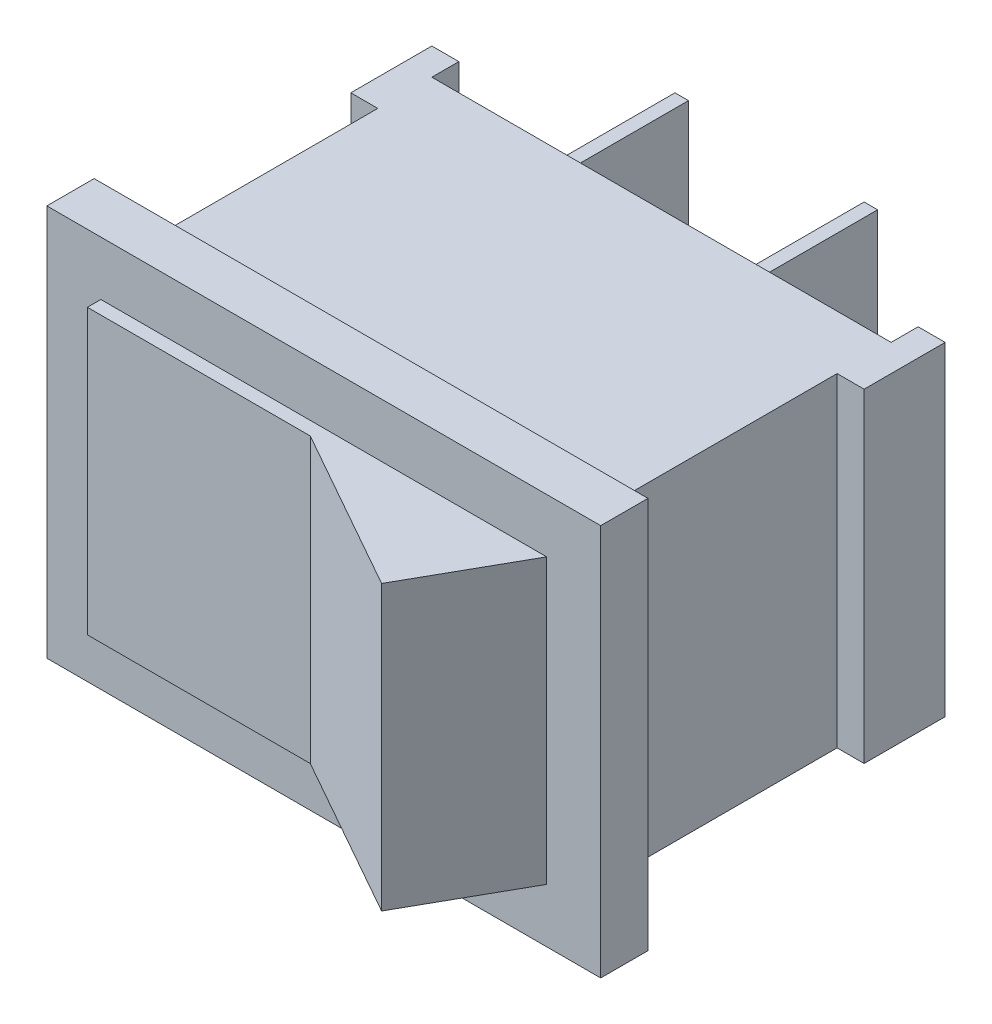
ISO-10303-21;
HEADER;
FILE_DESCRIPTION(('STEP AP214'),'2;1');
FILE_NAME('part.step','',(''),(''),'','','');
FILE_SCHEMA(('AUTOMOTIVE_DESIGN { 1 0 10303 214 1 1 1 1 }'));
ENDSEC;
DATA;
#1=APPLICATION_CONTEXT('core data for automotive mechanical design processes');
#2=APPLICATION_PROTOCOL_DEFINITION('international standard','automotive_design',2000,#1);
#3=PRODUCT_CONTEXT('',#1,'mechanical');
#4=PRODUCT('Part','Part','',(#3));
#5=PRODUCT_RELATED_PRODUCT_CATEGORY('part','',(#4));
#6=PRODUCT_DEFINITION_FORMATION('','',#4);
#7=PRODUCT_DEFINITION_CONTEXT('part definition',#1,'design');
#8=PRODUCT_DEFINITION('design','',#6,#7);
#9=PRODUCT_DEFINITION_SHAPE('','',#8);
#10=(LENGTH_UNIT() NAMED_UNIT(*) SI_UNIT(.MILLI.,.METRE.));
#11=(NAMED_UNIT(*) PLANE_ANGLE_UNIT() SI_UNIT($,.RADIAN.));
#12=(NAMED_UNIT(*) SI_UNIT($,.STERADIAN.) SOLID_ANGLE_UNIT());
#13=UNCERTAINTY_MEASURE_WITH_UNIT(LENGTH_MEASURE(1.E-05),#10,'distance_accuracy_value','');
#14=(GEOMETRIC_REPRESENTATION_CONTEXT(3) GLOBAL_UNCERTAINTY_ASSIGNED_CONTEXT((#13)) GLOBAL_UNIT_ASSIGNED_CONTEXT((#10,
#11,#12)) REPRESENTATION_CONTEXT('',''));
#15=CARTESIAN_POINT('',(0.,0.,0.));
#16=DIRECTION('',(0.,0.,1.));
#17=DIRECTION('',(1.,0.,0.));
#18=AXIS2_PLACEMENT_3D('',#15,#16,#17);
#19=CARTESIAN_POINT('',(0.,0.,-10.75));
#20=DIRECTION('',(0.,0.,-1.));
#21=DIRECTION('',(-1.,0.,0.));
#22=AXIS2_PLACEMENT_3D('',#19,#20,#21);
#23=PLANE('',#22);
#24=DIRECTION('',(-1.,0.,0.));
#25=VECTOR('',#24,1.);
#26=CARTESIAN_POINT('',(-7.5,-2.,-10.75));
#27=LINE('',#26,#25);
#28=CARTESIAN_POINT('',(-7.,-2.,-10.75));
#29=VERTEX_POINT('',#28);
#30=CARTESIAN_POINT('',(-7.5,-2.,-10.75));
#31=VERTEX_POINT('',#30);
#32=EDGE_CURVE('E256',#29,#31,#27,.T.);
#33=ORIENTED_EDGE('',*,*,#32,.F.);
#34=DIRECTION('',(0.,-1.,0.));
#35=VECTOR('',#34,1.);
#36=CARTESIAN_POINT('',(-7.,-2.,-10.75));
#37=LINE('',#36,#35);
#38=CARTESIAN_POINT('',(-7.,2.,-10.75));
#39=VERTEX_POINT('',#38);
#40=EDGE_CURVE('E253',#39,#29,#37,.T.);
#41=ORIENTED_EDGE('',*,*,#40,.F.);
#42=DIRECTION('',(1.,0.,0.));
#43=VECTOR('',#42,1.);
#44=CARTESIAN_POINT('',(-7.5,2.,-10.75));
#45=LINE('',#44,#43);
#46=CARTESIAN_POINT('',(-7.5,2.,-10.75));
#47=VERTEX_POINT('',#46);
#48=EDGE_CURVE('E265',#47,#39,#45,.T.);
#49=ORIENTED_EDGE('',*,*,#48,.F.);
#50=DIRECTION('',(0.,1.,0.));
#51=VECTOR('',#50,1.);
#52=CARTESIAN_POINT('',(-7.5,-2.,-10.75));
#53=LINE('',#52,#51);
#54=EDGE_CURVE('E273',#31,#47,#53,.T.);
#55=ORIENTED_EDGE('',*,*,#54,.F.);
#56=EDGE_LOOP('',(#33,#41,#49,#55));
#57=FACE_BOUND('',#56,.T.);
#58=DIRECTION('',(0.,-1.,0.));
#59=VECTOR('',#58,1.);
#60=CARTESIAN_POINT('',(8.5,-6.,-10.75));
#61=LINE('',#60,#59);
#62=CARTESIAN_POINT('',(8.5,6.,-10.75));
#63=VERTEX_POINT('',#62);
#64=CARTESIAN_POINT('',(8.5,-6.,-10.75));
#65=VERTEX_POINT('',#64);
#66=EDGE_CURVE('E380',#63,#65,#61,.T.);
#67=ORIENTED_EDGE('',*,*,#66,.T.);
#68=DIRECTION('',(-1.,0.,0.));
#69=VECTOR('',#68,1.);
#70=CARTESIAN_POINT('',(-8.5,-6.,-10.75));
#71=LINE('',#70,#69);
#72=CARTESIAN_POINT('',(-8.5,-6.,-10.75));
#73=VERTEX_POINT('',#72);
#74=EDGE_CURVE('E383',#65,#73,#71,.T.);
#75=ORIENTED_EDGE('',*,*,#74,.T.);
#76=DIRECTION('',(0.,1.,0.));
#77=VECTOR('',#76,1.);
#78=CARTESIAN_POINT('',(-8.5,-6.,-10.75));
#79=LINE('',#78,#77);
#80=CARTESIAN_POINT('',(-8.5,6.,-10.75));
#81=VERTEX_POINT('',#80);
#82=EDGE_CURVE('E387',#73,#81,#79,.T.);
#83=ORIENTED_EDGE('',*,*,#82,.T.);
#84=DIRECTION('',(1.,0.,0.));
#85=VECTOR('',#84,1.);
#86=CARTESIAN_POINT('',(-8.5,6.,-10.75));
#87=LINE('',#86,#85);
#88=EDGE_CURVE('E390',#81,#63,#87,.T.);
#89=ORIENTED_EDGE('',*,*,#88,.T.);
#90=EDGE_LOOP('',(#67,#75,#83,#89));
#91=FACE_BOUND('',#90,.T.);
#92=DIRECTION('',(1.,0.,0.));
#93=VECTOR('',#92,1.);
#94=CARTESIAN_POINT('',(0.,2.,-10.75));
#95=LINE('',#94,#93);
#96=CARTESIAN_POINT('',(-0.499999999999998,2.,-10.75));
#97=VERTEX_POINT('',#96);
#98=CARTESIAN_POINT('',(0.,2.,-10.75));
#99=VERTEX_POINT('',#98);
#100=EDGE_CURVE('E812',#97,#99,#95,.T.);
#101=ORIENTED_EDGE('',*,*,#100,.F.);
#102=DIRECTION('',(0.,1.,0.));
#103=VECTOR('',#102,1.);
#104=CARTESIAN_POINT('',(-0.499999999999998,-1.99999999999999,-10.75));
#105=LINE('',#104,#103);
#106=CARTESIAN_POINT('',(-0.499999999999998,-1.99999999999999,-10.75));
#107=VERTEX_POINT('',#106);
#108=EDGE_CURVE('E251',#107,#97,#105,.T.);
#109=ORIENTED_EDGE('',*,*,#108,.F.);
#110=DIRECTION('',(-1.,0.,0.));
#111=VECTOR('',#110,1.);
#112=CARTESIAN_POINT('',(0.,-1.99999999999999,-10.75));
#113=LINE('',#112,#111);
#114=CARTESIAN_POINT('',(0.,-1.99999999999999,-10.75));
#115=VERTEX_POINT('',#114);
#116=EDGE_CURVE('E247',#115,#107,#113,.T.);
#117=ORIENTED_EDGE('',*,*,#116,.F.);
#118=DIRECTION('',(0.,-1.,0.));
#119=VECTOR('',#118,1.);
#120=CARTESIAN_POINT('',(0.,-1.99999999999999,-10.75));
#121=LINE('',#120,#119);
#122=EDGE_CURVE('E809',#99,#115,#121,.T.);
#123=ORIENTED_EDGE('',*,*,#122,.F.);
#124=EDGE_LOOP('',(#101,#109,#117,#123));
#125=FACE_BOUND('',#124,.T.);
#126=ADVANCED_FACE('F36',(#57,#91,#125),#23,.T.);
#127=CARTESIAN_POINT('',(0.,0.,1.75));
#128=DIRECTION('',(0.,0.,1.));
#129=DIRECTION('',(1.,0.,0.));
#130=AXIS2_PLACEMENT_3D('',#127,#128,#129);
#131=PLANE('',#130);
#132=DIRECTION('',(0.,-1.,0.));
#133=VECTOR('',#132,1.);
#134=CARTESIAN_POINT('',(-10.25,-7.25,1.75));
#135=LINE('',#134,#133);
#136=CARTESIAN_POINT('',(-10.25,7.25,1.75));
#137=VERTEX_POINT('',#136);
#138=CARTESIAN_POINT('',(-10.25,-7.25,1.75));
#139=VERTEX_POINT('',#138);
#140=EDGE_CURVE('E412',#137,#139,#135,.T.);
#141=ORIENTED_EDGE('',*,*,#140,.T.);
#142=DIRECTION('',(1.,0.,0.));
#143=VECTOR('',#142,1.);
#144=CARTESIAN_POINT('',(10.25,-7.25,1.75));
#145=LINE('',#144,#143);
#146=CARTESIAN_POINT('',(10.25,-7.25,1.75));
#147=VERTEX_POINT('',#146);
#148=EDGE_CURVE('E415',#139,#147,#145,.T.);
#149=ORIENTED_EDGE('',*,*,#148,.T.);
#150=DIRECTION('',(0.,1.,0.));
#151=VECTOR('',#150,1.);
#152=CARTESIAN_POINT('',(10.25,-7.25,1.75));
#153=LINE('',#152,#151);
#154=CARTESIAN_POINT('',(10.25,7.25000000000001,1.75));
#155=VERTEX_POINT('',#154);
#156=EDGE_CURVE('E418',#147,#155,#153,.T.);
#157=ORIENTED_EDGE('',*,*,#156,.T.);
#158=DIRECTION('',(-1.,0.,0.));
#159=VECTOR('',#158,1.);
#160=CARTESIAN_POINT('',(10.25,7.25000000000001,1.75));
#161=LINE('',#160,#159);
#162=EDGE_CURVE('E420',#155,#137,#161,.T.);
#163=ORIENTED_EDGE('',*,*,#162,.T.);
#164=EDGE_LOOP('',(#141,#149,#157,#163));
#165=FACE_BOUND('',#164,.T.);
#166=DIRECTION('',(-1.,0.,0.));
#167=VECTOR('',#166,1.);
#168=CARTESIAN_POINT('',(0.,5.25000000000001,1.75));
#169=LINE('',#168,#167);
#170=CARTESIAN_POINT('',(8.25,5.25000000000001,1.75));
#171=VERTEX_POINT('',#170);
#172=CARTESIAN_POINT('',(-8.25000000000001,5.25,1.75));
#173=VERTEX_POINT('',#172);
#174=EDGE_CURVE('E299',#171,#173,#169,.T.);
#175=ORIENTED_EDGE('',*,*,#174,.F.);
#176=DIRECTION('',(0.,1.,0.));
#177=VECTOR('',#176,1.);
#178=CARTESIAN_POINT('',(8.25,-14.3786663634202,1.75));
#179=LINE('',#178,#177);
#180=CARTESIAN_POINT('',(8.25,-5.25,1.75));
#181=VERTEX_POINT('',#180);
#182=EDGE_CURVE('E288',#181,#171,#179,.T.);
#183=ORIENTED_EDGE('',*,*,#182,.F.);
#184=DIRECTION('',(1.,0.,0.));
#185=VECTOR('',#184,1.);
#186=CARTESIAN_POINT('',(0.,-5.25,1.75));
#187=LINE('',#186,#185);
#188=CARTESIAN_POINT('',(-8.25,-5.25,1.75));
#189=VERTEX_POINT('',#188);
#190=EDGE_CURVE('E304',#189,#181,#187,.T.);
#191=ORIENTED_EDGE('',*,*,#190,.F.);
#192=DIRECTION('',(0.,-1.,0.));
#193=VECTOR('',#192,1.);
#194=CARTESIAN_POINT('',(-8.25000000000001,5.25,1.75));
#195=LINE('',#194,#193);
#196=EDGE_CURVE('E313',#173,#189,#195,.T.);
#197=ORIENTED_EDGE('',*,*,#196,.F.);
#198=EDGE_LOOP('',(#175,#183,#191,#197));
#199=FACE_BOUND('',#198,.T.);
#200=ADVANCED_FACE('F455',(#165,#199),#131,.T.);
#201=CARTESIAN_POINT('',(-8.5,-6.,-10.75));
#202=DIRECTION('',(1.,0.,0.));
#203=DIRECTION('',(0.,0.,-1.));
#204=AXIS2_PLACEMENT_3D('',#201,#202,#203);
#205=PLANE('',#204);
#206=DIRECTION('',(0.,1.,0.));
#207=VECTOR('',#206,1.);
#208=CARTESIAN_POINT('',(-8.5,6.,-8.75));
#209=LINE('',#208,#207);
#210=CARTESIAN_POINT('',(-8.5,-6.,-8.75));
#211=VERTEX_POINT('',#210);
#212=CARTESIAN_POINT('',(-8.5,6.,-8.75));
#213=VERTEX_POINT('',#212);
#214=EDGE_CURVE('E321',#211,#213,#209,.T.);
#215=ORIENTED_EDGE('',*,*,#214,.F.);
#216=DIRECTION('',(0.,0.,1.));
#217=VECTOR('',#216,1.);
#218=CARTESIAN_POINT('',(-8.5,-6.,-10.75));
#219=LINE('',#218,#217);
#220=CARTESIAN_POINT('',(-8.5,-6.,0.));
#221=VERTEX_POINT('',#220);
#222=EDGE_CURVE('E407',#211,#221,#219,.T.);
#223=ORIENTED_EDGE('',*,*,#222,.T.);
#224=DIRECTION('',(0.,1.,0.));
#225=VECTOR('',#224,1.);
#226=CARTESIAN_POINT('',(-8.5,-6.,0.));
#227=LINE('',#226,#225);
#228=CARTESIAN_POINT('',(-8.5,6.,0.));
#229=VERTEX_POINT('',#228);
#230=EDGE_CURVE('E399',#221,#229,#227,.T.);
#231=ORIENTED_EDGE('',*,*,#230,.T.);
#232=DIRECTION('',(0.,0.,1.));
#233=VECTOR('',#232,1.);
#234=CARTESIAN_POINT('',(-8.5,6.,-10.75));
#235=LINE('',#234,#233);
#236=EDGE_CURVE('E405',#213,#229,#235,.T.);
#237=ORIENTED_EDGE('',*,*,#236,.F.);
#238=EDGE_LOOP('',(#215,#223,#231,#237));
#239=FACE_BOUND('',#238,.T.);
#240=ADVANCED_FACE('F470',(#239),#205,.F.);
#241=CARTESIAN_POINT('',(8.5,-6.,-10.75));
#242=DIRECTION('',(-1.,0.,0.));
#243=DIRECTION('',(0.,0.,1.));
#244=AXIS2_PLACEMENT_3D('',#241,#242,#243);
#245=PLANE('',#244);
#246=DIRECTION('',(0.,-1.,0.));
#247=VECTOR('',#246,1.);
#248=CARTESIAN_POINT('',(8.5,6.,-8.75));
#249=LINE('',#248,#247);
#250=CARTESIAN_POINT('',(8.5,6.,-8.75));
#251=VERTEX_POINT('',#250);
#252=CARTESIAN_POINT('',(8.5,-6.,-8.75));
#253=VERTEX_POINT('',#252);
#254=EDGE_CURVE('E350',#251,#253,#249,.T.);
#255=ORIENTED_EDGE('',*,*,#254,.F.);
#256=DIRECTION('',(0.,0.,1.));
#257=VECTOR('',#256,1.);
#258=CARTESIAN_POINT('',(8.5,6.,-10.75));
#259=LINE('',#258,#257);
#260=CARTESIAN_POINT('',(8.5,6.,0.));
#261=VERTEX_POINT('',#260);
#262=EDGE_CURVE('E393',#251,#261,#259,.T.);
#263=ORIENTED_EDGE('',*,*,#262,.T.);
#264=DIRECTION('',(0.,-1.,0.));
#265=VECTOR('',#264,1.);
#266=CARTESIAN_POINT('',(8.5,-6.,0.));
#267=LINE('',#266,#265);
#268=CARTESIAN_POINT('',(8.5,-6.,0.));
#269=VERTEX_POINT('',#268);
#270=EDGE_CURVE('E379',#261,#269,#267,.T.);
#271=ORIENTED_EDGE('',*,*,#270,.T.);
#272=DIRECTION('',(0.,0.,1.));
#273=VECTOR('',#272,1.);
#274=CARTESIAN_POINT('',(8.5,-6.,-10.75));
#275=LINE('',#274,#273);
#276=EDGE_CURVE('E409',#253,#269,#275,.T.);
#277=ORIENTED_EDGE('',*,*,#276,.F.);
#278=EDGE_LOOP('',(#255,#263,#271,#277));
#279=FACE_BOUND('',#278,.T.);
#280=ADVANCED_FACE('F485',(#279),#245,.F.);
#281=CARTESIAN_POINT('',(0.,0.,0.));
#282=DIRECTION('',(0.,0.,1.));
#283=DIRECTION('',(1.,0.,0.));
#284=AXIS2_PLACEMENT_3D('',#281,#282,#283);
#285=PLANE('',#284);
#286=DIRECTION('',(0.,-1.,0.));
#287=VECTOR('',#286,1.);
#288=CARTESIAN_POINT('',(-10.25,-7.25,0.));
#289=LINE('',#288,#287);
#290=CARTESIAN_POINT('',(-10.25,7.25,0.));
#291=VERTEX_POINT('',#290);
#292=CARTESIAN_POINT('',(-10.25,-7.25,0.));
#293=VERTEX_POINT('',#292);
#294=EDGE_CURVE('E411',#291,#293,#289,.T.);
#295=ORIENTED_EDGE('',*,*,#294,.F.);
#296=DIRECTION('',(-1.,0.,0.));
#297=VECTOR('',#296,1.);
#298=CARTESIAN_POINT('',(10.25,7.25000000000001,0.));
#299=LINE('',#298,#297);
#300=CARTESIAN_POINT('',(10.25,7.25000000000001,0.));
#301=VERTEX_POINT('',#300);
#302=EDGE_CURVE('E416',#301,#291,#299,.T.);
#303=ORIENTED_EDGE('',*,*,#302,.F.);
#304=DIRECTION('',(0.,1.,0.));
#305=VECTOR('',#304,1.);
#306=CARTESIAN_POINT('',(10.25,-7.25,0.));
#307=LINE('',#306,#305);
#308=CARTESIAN_POINT('',(10.25,-7.25,0.));
#309=VERTEX_POINT('',#308);
#310=EDGE_CURVE('E427',#309,#301,#307,.T.);
#311=ORIENTED_EDGE('',*,*,#310,.F.);
#312=DIRECTION('',(1.,0.,0.));
#313=VECTOR('',#312,1.);
#314=CARTESIAN_POINT('',(10.25,-7.25,0.));
#315=LINE('',#314,#313);
#316=EDGE_CURVE('E425',#293,#309,#315,.T.);
#317=ORIENTED_EDGE('',*,*,#316,.F.);
#318=EDGE_LOOP('',(#295,#303,#311,#317));
#319=FACE_BOUND('',#318,.T.);
#320=ORIENTED_EDGE('',*,*,#270,.F.);
#321=DIRECTION('',(1.,0.,0.));
#322=VECTOR('',#321,1.);
#323=CARTESIAN_POINT('',(-8.5,6.,0.));
#324=LINE('',#323,#322);
#325=EDGE_CURVE('E384',#229,#261,#324,.T.);
#326=ORIENTED_EDGE('',*,*,#325,.F.);
#327=ORIENTED_EDGE('',*,*,#230,.F.);
#328=DIRECTION('',(-1.,0.,0.));
#329=VECTOR('',#328,1.);
#330=CARTESIAN_POINT('',(-8.5,-6.,0.));
#331=LINE('',#330,#329);
#332=EDGE_CURVE('E396',#269,#221,#331,.T.);
#333=ORIENTED_EDGE('',*,*,#332,.F.);
#334=EDGE_LOOP('',(#320,#326,#327,#333));
#335=FACE_BOUND('',#334,.T.);
#336=ADVANCED_FACE('F445',(#319,#335),#285,.F.);
#337=CARTESIAN_POINT('',(-10.25,-7.25,1.75));
#338=DIRECTION('',(1.,0.,0.));
#339=DIRECTION('',(0.,0.,-1.));
#340=AXIS2_PLACEMENT_3D('',#337,#338,#339);
#341=PLANE('',#340);
#342=ORIENTED_EDGE('',*,*,#294,.T.);
#343=DIRECTION('',(0.,0.,-1.));
#344=VECTOR('',#343,1.);
#345=CARTESIAN_POINT('',(-10.25,-7.25,1.75));
#346=LINE('',#345,#344);
#347=EDGE_CURVE('E11',#139,#293,#346,.T.);
#348=ORIENTED_EDGE('',*,*,#347,.F.);
#349=ORIENTED_EDGE('',*,*,#140,.F.);
#350=DIRECTION('',(0.,0.,-1.));
#351=VECTOR('',#350,1.);
#352=CARTESIAN_POINT('',(-10.25,7.25,1.75));
#353=LINE('',#352,#351);
#354=EDGE_CURVE('E422',#137,#291,#353,.T.);
#355=ORIENTED_EDGE('',*,*,#354,.T.);
#356=EDGE_LOOP('',(#342,#348,#349,#355));
#357=FACE_BOUND('',#356,.T.);
#358=ADVANCED_FACE('F38',(#357),#341,.F.);
#359=CARTESIAN_POINT('',(10.25,-7.25,1.75));
#360=DIRECTION('',(0.,1.,0.));
#361=DIRECTION('',(-1.,0.,0.));
#362=AXIS2_PLACEMENT_3D('',#359,#360,#361);
#363=PLANE('',#362);
#364=ORIENTED_EDGE('',*,*,#316,.T.);
#365=DIRECTION('',(0.,0.,-1.));
#366=VECTOR('',#365,1.);
#367=CARTESIAN_POINT('',(10.25,-7.25,1.75));
#368=LINE('',#367,#366);
#369=EDGE_CURVE('E44',#147,#309,#368,.T.);
#370=ORIENTED_EDGE('',*,*,#369,.F.);
#371=ORIENTED_EDGE('',*,*,#148,.F.);
#372=ORIENTED_EDGE('',*,*,#347,.T.);
#373=EDGE_LOOP('',(#364,#370,#371,#372));
#374=FACE_BOUND('',#373,.T.);
#375=ADVANCED_FACE('F457',(#374),#363,.F.);
#376=CARTESIAN_POINT('',(10.25,-7.25,1.75));
#377=DIRECTION('',(-1.,0.,0.));
#378=DIRECTION('',(0.,0.,1.));
#379=AXIS2_PLACEMENT_3D('',#376,#377,#378);
#380=PLANE('',#379);
#381=ORIENTED_EDGE('',*,*,#310,.T.);
#382=DIRECTION('',(0.,0.,-1.));
#383=VECTOR('',#382,1.);
#384=CARTESIAN_POINT('',(10.25,7.25000000000001,1.75));
#385=LINE('',#384,#383);
#386=EDGE_CURVE('E432',#155,#301,#385,.T.);
#387=ORIENTED_EDGE('',*,*,#386,.F.);
#388=ORIENTED_EDGE('',*,*,#156,.F.);
#389=ORIENTED_EDGE('',*,*,#369,.T.);
#390=EDGE_LOOP('',(#381,#387,#388,#389));
#391=FACE_BOUND('',#390,.T.);
#392=ADVANCED_FACE('F439',(#391),#380,.F.);
#393=CARTESIAN_POINT('',(10.25,7.25000000000001,1.75));
#394=DIRECTION('',(0.,-1.,0.));
#395=DIRECTION('',(1.,0.,0.));
#396=AXIS2_PLACEMENT_3D('',#393,#394,#395);
#397=PLANE('',#396);
#398=ORIENTED_EDGE('',*,*,#302,.T.);
#399=ORIENTED_EDGE('',*,*,#354,.F.);
#400=ORIENTED_EDGE('',*,*,#162,.F.);
#401=ORIENTED_EDGE('',*,*,#386,.T.);
#402=EDGE_LOOP('',(#398,#399,#400,#401));
#403=FACE_BOUND('',#402,.T.);
#404=ADVANCED_FACE('F449',(#403),#397,.F.);
#405=CARTESIAN_POINT('',(-8.5,-6.,-10.75));
#406=DIRECTION('',(0.,1.,0.));
#407=DIRECTION('',(-1.,0.,0.));
#408=AXIS2_PLACEMENT_3D('',#405,#406,#407);
#409=PLANE('',#408);
#410=ORIENTED_EDGE('',*,*,#332,.T.);
#411=ORIENTED_EDGE('',*,*,#222,.F.);
#412=DIRECTION('',(1.,0.,0.));
#413=VECTOR('',#412,1.);
#414=CARTESIAN_POINT('',(-9.5,-6.,-8.75));
#415=LINE('',#414,#413);
#416=CARTESIAN_POINT('',(-9.5,-6.,-8.75));
#417=VERTEX_POINT('',#416);
#418=EDGE_CURVE('E332',#417,#211,#415,.T.);
#419=ORIENTED_EDGE('',*,*,#418,.F.);
#420=DIRECTION('',(0.,0.,1.));
#421=VECTOR('',#420,1.);
#422=CARTESIAN_POINT('',(-9.5,-6.,-8.75));
#423=LINE('',#422,#421);
#424=CARTESIAN_POINT('',(-9.5,-6.,-11.75));
#425=VERTEX_POINT('',#424);
#426=EDGE_CURVE('E330',#425,#417,#423,.T.);
#427=ORIENTED_EDGE('',*,*,#426,.F.);
#428=DIRECTION('',(1.,0.,0.));
#429=VECTOR('',#428,1.);
#430=CARTESIAN_POINT('',(-9.5,-6.,-11.75));
#431=LINE('',#430,#429);
#432=CARTESIAN_POINT('',(-8.5,-6.,-11.75));
#433=VERTEX_POINT('',#432);
#434=EDGE_CURVE('E342',#425,#433,#431,.T.);
#435=ORIENTED_EDGE('',*,*,#434,.T.);
#436=DIRECTION('',(0.,0.,1.));
#437=VECTOR('',#436,1.);
#438=CARTESIAN_POINT('',(-8.5,-6.,-8.75));
#439=LINE('',#438,#437);
#440=EDGE_CURVE('E326',#433,#73,#439,.T.);
#441=ORIENTED_EDGE('',*,*,#440,.T.);
#442=ORIENTED_EDGE('',*,*,#74,.F.);
#443=DIRECTION('',(0.,0.,-1.));
#444=VECTOR('',#443,1.);
#445=CARTESIAN_POINT('',(8.5,-6.,-8.75));
#446=LINE('',#445,#444);
#447=CARTESIAN_POINT('',(8.5,-6.,-11.75));
#448=VERTEX_POINT('',#447);
#449=EDGE_CURVE('E364',#65,#448,#446,.T.);
#450=ORIENTED_EDGE('',*,*,#449,.T.);
#451=DIRECTION('',(-1.,0.,0.));
#452=VECTOR('',#451,1.);
#453=CARTESIAN_POINT('',(9.50000000000001,-6.,-11.75));
#454=LINE('',#453,#452);
#455=CARTESIAN_POINT('',(9.50000000000001,-6.,-11.75));
#456=VERTEX_POINT('',#455);
#457=EDGE_CURVE('E374',#456,#448,#454,.T.);
#458=ORIENTED_EDGE('',*,*,#457,.F.);
#459=DIRECTION('',(0.,0.,-1.));
#460=VECTOR('',#459,1.);
#461=CARTESIAN_POINT('',(9.50000000000001,-6.,-8.75));
#462=LINE('',#461,#460);
#463=CARTESIAN_POINT('',(9.50000000000001,-6.,-8.75));
#464=VERTEX_POINT('',#463);
#465=EDGE_CURVE('E354',#464,#456,#462,.T.);
#466=ORIENTED_EDGE('',*,*,#465,.F.);
#467=DIRECTION('',(-1.,0.,0.));
#468=VECTOR('',#467,1.);
#469=CARTESIAN_POINT('',(9.50000000000001,-6.,-8.75));
#470=LINE('',#469,#468);
#471=EDGE_CURVE('E377',#464,#253,#470,.T.);
#472=ORIENTED_EDGE('',*,*,#471,.T.);
#473=ORIENTED_EDGE('',*,*,#276,.T.);
#474=EDGE_LOOP('',(#410,#411,#419,#427,#435,#441,#442,#450,#458,#466,#472,#473));
#475=FACE_BOUND('',#474,.T.);
#476=ADVANCED_FACE('F481',(#475),#409,.F.);
#477=CARTESIAN_POINT('',(-8.5,6.,-10.75));
#478=DIRECTION('',(0.,-1.,0.));
#479=DIRECTION('',(1.,0.,0.));
#480=AXIS2_PLACEMENT_3D('',#477,#478,#479);
#481=PLANE('',#480);
#482=ORIENTED_EDGE('',*,*,#325,.T.);
#483=ORIENTED_EDGE('',*,*,#262,.F.);
#484=DIRECTION('',(-1.,0.,0.));
#485=VECTOR('',#484,1.);
#486=CARTESIAN_POINT('',(9.50000000000001,6.,-8.75));
#487=LINE('',#486,#485);
#488=CARTESIAN_POINT('',(9.50000000000001,6.,-8.75));
#489=VERTEX_POINT('',#488);
#490=EDGE_CURVE('E361',#489,#251,#487,.T.);
#491=ORIENTED_EDGE('',*,*,#490,.F.);
#492=DIRECTION('',(0.,0.,1.));
#493=VECTOR('',#492,1.);
#494=CARTESIAN_POINT('',(9.50000000000001,6.,-8.75));
#495=LINE('',#494,#493);
#496=CARTESIAN_POINT('',(9.50000000000001,6.,-11.75));
#497=VERTEX_POINT('',#496);
#498=EDGE_CURVE('E359',#497,#489,#495,.T.);
#499=ORIENTED_EDGE('',*,*,#498,.F.);
#500=DIRECTION('',(-1.,0.,0.));
#501=VECTOR('',#500,1.);
#502=CARTESIAN_POINT('',(9.50000000000001,6.,-11.75));
#503=LINE('',#502,#501);
#504=CARTESIAN_POINT('',(8.5,6.,-11.75));
#505=VERTEX_POINT('',#504);
#506=EDGE_CURVE('E371',#497,#505,#503,.T.);
#507=ORIENTED_EDGE('',*,*,#506,.T.);
#508=DIRECTION('',(0.,0.,1.));
#509=VECTOR('',#508,1.);
#510=CARTESIAN_POINT('',(8.5,6.,-8.75));
#511=LINE('',#510,#509);
#512=EDGE_CURVE('E355',#505,#63,#511,.T.);
#513=ORIENTED_EDGE('',*,*,#512,.T.);
#514=ORIENTED_EDGE('',*,*,#88,.F.);
#515=DIRECTION('',(0.,0.,-1.));
#516=VECTOR('',#515,1.);
#517=CARTESIAN_POINT('',(-8.5,6.,-8.75));
#518=LINE('',#517,#516);
#519=CARTESIAN_POINT('',(-8.5,6.,-11.75));
#520=VERTEX_POINT('',#519);
#521=EDGE_CURVE('E335',#81,#520,#518,.T.);
#522=ORIENTED_EDGE('',*,*,#521,.T.);
#523=DIRECTION('',(1.,0.,0.));
#524=VECTOR('',#523,1.);
#525=CARTESIAN_POINT('',(-9.5,6.,-11.75));
#526=LINE('',#525,#524);
#527=CARTESIAN_POINT('',(-9.5,6.,-11.75));
#528=VERTEX_POINT('',#527);
#529=EDGE_CURVE('E345',#528,#520,#526,.T.);
#530=ORIENTED_EDGE('',*,*,#529,.F.);
#531=DIRECTION('',(0.,0.,-1.));
#532=VECTOR('',#531,1.);
#533=CARTESIAN_POINT('',(-9.5,6.,-8.75));
#534=LINE('',#533,#532);
#535=CARTESIAN_POINT('',(-9.5,6.,-8.75));
#536=VERTEX_POINT('',#535);
#537=EDGE_CURVE('E325',#536,#528,#534,.T.);
#538=ORIENTED_EDGE('',*,*,#537,.F.);
#539=DIRECTION('',(1.,0.,0.));
#540=VECTOR('',#539,1.);
#541=CARTESIAN_POINT('',(-9.5,6.,-8.75));
#542=LINE('',#541,#540);
#543=EDGE_CURVE('E348',#536,#213,#542,.T.);
#544=ORIENTED_EDGE('',*,*,#543,.T.);
#545=ORIENTED_EDGE('',*,*,#236,.T.);
#546=EDGE_LOOP('',(#482,#483,#491,#499,#507,#513,#514,#522,#530,#538,#544,#545));
#547=FACE_BOUND('',#546,.T.);
#548=ADVANCED_FACE('F478',(#547),#481,.F.);
#549=CARTESIAN_POINT('',(9.50000000000001,6.,-8.75));
#550=DIRECTION('',(0.,0.,-1.));
#551=DIRECTION('',(0.,1.,0.));
#552=AXIS2_PLACEMENT_3D('',#549,#550,#551);
#553=PLANE('',#552);
#554=ORIENTED_EDGE('',*,*,#254,.T.);
#555=ORIENTED_EDGE('',*,*,#471,.F.);
#556=DIRECTION('',(0.,-1.,0.));
#557=VECTOR('',#556,1.);
#558=CARTESIAN_POINT('',(9.50000000000001,6.,-8.75));
#559=LINE('',#558,#557);
#560=EDGE_CURVE('E351',#489,#464,#559,.T.);
#561=ORIENTED_EDGE('',*,*,#560,.F.);
#562=ORIENTED_EDGE('',*,*,#490,.T.);
#563=EDGE_LOOP('',(#554,#555,#561,#562));
#564=FACE_BOUND('',#563,.T.);
#565=ADVANCED_FACE('F476',(#564),#553,.F.);
#566=CARTESIAN_POINT('',(9.50000000000001,6.,-11.75));
#567=DIRECTION('',(0.,0.,1.));
#568=DIRECTION('',(0.,-1.,0.));
#569=AXIS2_PLACEMENT_3D('',#566,#567,#568);
#570=PLANE('',#569);
#571=DIRECTION('',(0.,1.,0.));
#572=VECTOR('',#571,1.);
#573=CARTESIAN_POINT('',(8.5,6.,-11.75));
#574=LINE('',#573,#572);
#575=EDGE_CURVE('E366',#448,#505,#574,.T.);
#576=ORIENTED_EDGE('',*,*,#575,.T.);
#577=ORIENTED_EDGE('',*,*,#506,.F.);
#578=DIRECTION('',(0.,1.,0.));
#579=VECTOR('',#578,1.);
#580=CARTESIAN_POINT('',(9.50000000000001,6.,-11.75));
#581=LINE('',#580,#579);
#582=EDGE_CURVE('E357',#456,#497,#581,.T.);
#583=ORIENTED_EDGE('',*,*,#582,.F.);
#584=ORIENTED_EDGE('',*,*,#457,.T.);
#585=EDGE_LOOP('',(#576,#577,#583,#584));
#586=FACE_BOUND('',#585,.T.);
#587=ADVANCED_FACE('F517',(#586),#570,.F.);
#588=CARTESIAN_POINT('',(9.50000000000001,0.,0.));
#589=DIRECTION('',(1.,0.,0.));
#590=DIRECTION('',(0.,0.,-1.));
#591=AXIS2_PLACEMENT_3D('',#588,#589,#590);
#592=PLANE('',#591);
#593=ORIENTED_EDGE('',*,*,#560,.T.);
#594=ORIENTED_EDGE('',*,*,#465,.T.);
#595=ORIENTED_EDGE('',*,*,#582,.T.);
#596=ORIENTED_EDGE('',*,*,#498,.T.);
#597=EDGE_LOOP('',(#593,#594,#595,#596));
#598=FACE_BOUND('',#597,.T.);
#599=ADVANCED_FACE('F525',(#598),#592,.T.);
#600=CARTESIAN_POINT('',(8.5,0.,0.));
#601=DIRECTION('',(1.,0.,0.));
#602=DIRECTION('',(0.,0.,-1.));
#603=AXIS2_PLACEMENT_3D('',#600,#601,#602);
#604=PLANE('',#603);
#605=ORIENTED_EDGE('',*,*,#66,.F.);
#606=ORIENTED_EDGE('',*,*,#512,.F.);
#607=ORIENTED_EDGE('',*,*,#575,.F.);
#608=ORIENTED_EDGE('',*,*,#449,.F.);
#609=EDGE_LOOP('',(#605,#606,#607,#608));
#610=FACE_BOUND('',#609,.T.);
#611=ADVANCED_FACE('F532',(#610),#604,.F.);
#612=CARTESIAN_POINT('',(-9.5,6.,-8.75));
#613=DIRECTION('',(0.,0.,-1.));
#614=DIRECTION('',(0.,1.,0.));
#615=AXIS2_PLACEMENT_3D('',#612,#613,#614);
#616=PLANE('',#615);
#617=ORIENTED_EDGE('',*,*,#214,.T.);
#618=ORIENTED_EDGE('',*,*,#543,.F.);
#619=DIRECTION('',(0.,1.,0.));
#620=VECTOR('',#619,1.);
#621=CARTESIAN_POINT('',(-9.5,6.,-8.75));
#622=LINE('',#621,#620);
#623=EDGE_CURVE('E322',#417,#536,#622,.T.);
#624=ORIENTED_EDGE('',*,*,#623,.F.);
#625=ORIENTED_EDGE('',*,*,#418,.T.);
#626=EDGE_LOOP('',(#617,#618,#624,#625));
#627=FACE_BOUND('',#626,.T.);
#628=ADVANCED_FACE('F540',(#627),#616,.F.);
#629=CARTESIAN_POINT('',(-9.5,6.,-11.75));
#630=DIRECTION('',(0.,0.,1.));
#631=DIRECTION('',(1.,0.,0.));
#632=AXIS2_PLACEMENT_3D('',#629,#630,#631);
#633=PLANE('',#632);
#634=DIRECTION('',(0.,-1.,0.));
#635=VECTOR('',#634,1.);
#636=CARTESIAN_POINT('',(-8.5,6.,-11.75));
#637=LINE('',#636,#635);
#638=EDGE_CURVE('E337',#520,#433,#637,.T.);
#639=ORIENTED_EDGE('',*,*,#638,.T.);
#640=ORIENTED_EDGE('',*,*,#434,.F.);
#641=DIRECTION('',(0.,-1.,0.));
#642=VECTOR('',#641,1.);
#643=CARTESIAN_POINT('',(-9.5,6.,-11.75));
#644=LINE('',#643,#642);
#645=EDGE_CURVE('E328',#528,#425,#644,.T.);
#646=ORIENTED_EDGE('',*,*,#645,.F.);
#647=ORIENTED_EDGE('',*,*,#529,.T.);
#648=EDGE_LOOP('',(#639,#640,#646,#647));
#649=FACE_BOUND('',#648,.T.);
#650=ADVANCED_FACE('F547',(#649),#633,.F.);
#651=CARTESIAN_POINT('',(-9.5,0.,0.));
#652=DIRECTION('',(1.,0.,0.));
#653=DIRECTION('',(0.,0.,-1.));
#654=AXIS2_PLACEMENT_3D('',#651,#652,#653);
#655=PLANE('',#654);
#656=ORIENTED_EDGE('',*,*,#623,.T.);
#657=ORIENTED_EDGE('',*,*,#537,.T.);
#658=ORIENTED_EDGE('',*,*,#645,.T.);
#659=ORIENTED_EDGE('',*,*,#426,.T.);
#660=EDGE_LOOP('',(#656,#657,#658,#659));
#661=FACE_BOUND('',#660,.T.);
#662=ADVANCED_FACE('F555',(#661),#655,.F.);
#663=CARTESIAN_POINT('',(-8.5,0.,0.));
#664=DIRECTION('',(1.,0.,0.));
#665=DIRECTION('',(0.,0.,-1.));
#666=AXIS2_PLACEMENT_3D('',#663,#664,#665);
#667=PLANE('',#666);
#668=ORIENTED_EDGE('',*,*,#521,.F.);
#669=ORIENTED_EDGE('',*,*,#82,.F.);
#670=ORIENTED_EDGE('',*,*,#440,.F.);
#671=ORIENTED_EDGE('',*,*,#638,.F.);
#672=EDGE_LOOP('',(#668,#669,#670,#671));
#673=FACE_BOUND('',#672,.T.);
#674=ADVANCED_FACE('F563',(#673),#667,.T.);
#675=CARTESIAN_POINT('',(0.,5.25000000000001,2.25));
#676=DIRECTION('',(0.,-1.,0.));
#677=DIRECTION('',(1.,0.,0.));
#678=AXIS2_PLACEMENT_3D('',#675,#676,#677);
#679=PLANE('',#678);
#680=ORIENTED_EDGE('',*,*,#174,.T.);
#681=DIRECTION('',(0.,0.,-1.));
#682=VECTOR('',#681,1.);
#683=CARTESIAN_POINT('',(-8.25000000000001,5.25,2.25));
#684=LINE('',#683,#682);
#685=CARTESIAN_POINT('',(-8.25000000000001,5.25,2.25));
#686=VERTEX_POINT('',#685);
#687=EDGE_CURVE('E318',#686,#173,#684,.T.);
#688=ORIENTED_EDGE('',*,*,#687,.F.);
#689=DIRECTION('',(-1.,0.,0.));
#690=VECTOR('',#689,1.);
#691=CARTESIAN_POINT('',(0.,5.25000000000001,2.25));
#692=LINE('',#691,#690);
#693=CARTESIAN_POINT('',(0.,5.25000000000001,2.25));
#694=VERTEX_POINT('',#693);
#695=EDGE_CURVE('E303',#694,#686,#692,.T.);
#696=ORIENTED_EDGE('',*,*,#695,.F.);
#697=DIRECTION('',(0.871238473308633,0.,0.490859982710795));
#698=VECTOR('',#697,1.);
#699=CARTESIAN_POINT('',(0.,5.25000000000001,2.25));
#700=LINE('',#699,#698);
#701=CARTESIAN_POINT('',(6.04838788735592,5.25000000000001,5.65769107973493));
#702=VERTEX_POINT('',#701);
#703=EDGE_CURVE('E284',#694,#702,#700,.T.);
#704=ORIENTED_EDGE('',*,*,#703,.T.);
#705=DIRECTION('',(0.490859982710795,0.,-0.871238473308633));
#706=VECTOR('',#705,1.);
#707=CARTESIAN_POINT('',(6.04838788735592,5.25000000000001,5.65769107973493));
#708=LINE('',#707,#706);
#709=EDGE_CURVE('E291',#702,#171,#708,.T.);
#710=ORIENTED_EDGE('',*,*,#709,.T.);
#711=EDGE_LOOP('',(#680,#688,#696,#704,#710));
#712=FACE_BOUND('',#711,.T.);
#713=ADVANCED_FACE('F571',(#712),#679,.F.);
#714=CARTESIAN_POINT('',(-8.25000000000001,5.25,2.25));
#715=DIRECTION('',(1.,0.,0.));
#716=DIRECTION('',(0.,1.,0.));
#717=AXIS2_PLACEMENT_3D('',#714,#715,#716);
#718=PLANE('',#717);
#719=ORIENTED_EDGE('',*,*,#196,.T.);
#720=DIRECTION('',(0.,0.,-1.));
#721=VECTOR('',#720,1.);
#722=CARTESIAN_POINT('',(-8.25,-5.25,2.25));
#723=LINE('',#722,#721);
#724=CARTESIAN_POINT('',(-8.25,-5.25,2.25));
#725=VERTEX_POINT('',#724);
#726=EDGE_CURVE('E311',#725,#189,#723,.T.);
#727=ORIENTED_EDGE('',*,*,#726,.F.);
#728=DIRECTION('',(0.,-1.,0.));
#729=VECTOR('',#728,1.);
#730=CARTESIAN_POINT('',(-8.25000000000001,5.25,2.25));
#731=LINE('',#730,#729);
#732=EDGE_CURVE('E306',#686,#725,#731,.T.);
#733=ORIENTED_EDGE('',*,*,#732,.F.);
#734=ORIENTED_EDGE('',*,*,#687,.T.);
#735=EDGE_LOOP('',(#719,#727,#733,#734));
#736=FACE_BOUND('',#735,.T.);
#737=ADVANCED_FACE('F580',(#736),#718,.F.);
#738=CARTESIAN_POINT('',(0.,-5.25,2.25));
#739=DIRECTION('',(0.,1.,0.));
#740=DIRECTION('',(-1.,0.,0.));
#741=AXIS2_PLACEMENT_3D('',#738,#739,#740);
#742=PLANE('',#741);
#743=ORIENTED_EDGE('',*,*,#190,.T.);
#744=DIRECTION('',(-0.490859982710795,0.,0.871238473308633));
#745=VECTOR('',#744,1.);
#746=CARTESIAN_POINT('',(6.04838788735593,-5.25,5.65769107973493));
#747=LINE('',#746,#745);
#748=CARTESIAN_POINT('',(6.04838788735593,-5.25,5.65769107973493));
#749=VERTEX_POINT('',#748);
#750=EDGE_CURVE('E285',#181,#749,#747,.T.);
#751=ORIENTED_EDGE('',*,*,#750,.T.);
#752=DIRECTION('',(-0.871238473308633,0.,-0.490859982710795));
#753=VECTOR('',#752,1.);
#754=CARTESIAN_POINT('',(0.,-5.25,2.25));
#755=LINE('',#754,#753);
#756=CARTESIAN_POINT('',(0.,-5.25,2.25));
#757=VERTEX_POINT('',#756);
#758=EDGE_CURVE('E287',#749,#757,#755,.T.);
#759=ORIENTED_EDGE('',*,*,#758,.T.);
#760=DIRECTION('',(1.,0.,0.));
#761=VECTOR('',#760,1.);
#762=CARTESIAN_POINT('',(0.,-5.25,2.25));
#763=LINE('',#762,#761);
#764=EDGE_CURVE('E308',#725,#757,#763,.T.);
#765=ORIENTED_EDGE('',*,*,#764,.F.);
#766=ORIENTED_EDGE('',*,*,#726,.T.);
#767=EDGE_LOOP('',(#743,#751,#759,#765,#766));
#768=FACE_BOUND('',#767,.T.);
#769=ADVANCED_FACE('F589',(#768),#742,.F.);
#770=CARTESIAN_POINT('',(0.,0.,2.25));
#771=DIRECTION('',(0.,0.,-1.));
#772=DIRECTION('',(-1.,0.,0.));
#773=AXIS2_PLACEMENT_3D('',#770,#771,#772);
#774=PLANE('',#773);
#775=DIRECTION('',(0.,1.,0.));
#776=VECTOR('',#775,1.);
#777=CARTESIAN_POINT('',(0.,5.25000000000001,2.25));
#778=LINE('',#777,#776);
#779=EDGE_CURVE('E300',#757,#694,#778,.T.);
#780=ORIENTED_EDGE('',*,*,#779,.T.);
#781=ORIENTED_EDGE('',*,*,#695,.T.);
#782=ORIENTED_EDGE('',*,*,#732,.T.);
#783=ORIENTED_EDGE('',*,*,#764,.T.);
#784=EDGE_LOOP('',(#780,#781,#782,#783));
#785=FACE_BOUND('',#784,.T.);
#786=ADVANCED_FACE('F596',(#785),#774,.F.);
#787=CARTESIAN_POINT('',(6.04838788735593,-14.3786663634202,5.65769107973493));
#788=DIRECTION('',(0.871238473308633,0.,0.490859982710795));
#789=DIRECTION('',(0.490859982710795,0.,-0.871238473308633));
#790=AXIS2_PLACEMENT_3D('',#787,#788,#789);
#791=PLANE('',#790);
#792=ORIENTED_EDGE('',*,*,#750,.F.);
#793=ORIENTED_EDGE('',*,*,#182,.T.);
#794=ORIENTED_EDGE('',*,*,#709,.F.);
#795=DIRECTION('',(0.,1.,0.));
#796=VECTOR('',#795,1.);
#797=CARTESIAN_POINT('',(6.04838788735593,-14.3786663634202,5.65769107973493));
#798=LINE('',#797,#796);
#799=EDGE_CURVE('E294',#749,#702,#798,.T.);
#800=ORIENTED_EDGE('',*,*,#799,.F.);
#801=EDGE_LOOP('',(#792,#793,#794,#800));
#802=FACE_BOUND('',#801,.T.);
#803=ADVANCED_FACE('F604',(#802),#791,.T.);
#804=CARTESIAN_POINT('',(0.,-14.3786663634202,2.25));
#805=DIRECTION('',(-0.490859982710795,0.,0.871238473308633));
#806=DIRECTION('',(0.871238473308633,0.,0.490859982710795));
#807=AXIS2_PLACEMENT_3D('',#804,#805,#806);
#808=PLANE('',#807);
#809=ORIENTED_EDGE('',*,*,#758,.F.);
#810=ORIENTED_EDGE('',*,*,#799,.T.);
#811=ORIENTED_EDGE('',*,*,#703,.F.);
#812=ORIENTED_EDGE('',*,*,#779,.F.);
#813=EDGE_LOOP('',(#809,#810,#811,#812));
#814=FACE_BOUND('',#813,.T.);
#815=ADVANCED_FACE('F612',(#814),#808,.T.);
#816=CARTESIAN_POINT('',(-7.,-2.,-18.75));
#817=DIRECTION('',(-1.,0.,0.));
#818=DIRECTION('',(0.,0.,1.));
#819=AXIS2_PLACEMENT_3D('',#816,#817,#818);
#820=PLANE('',#819);
#821=ORIENTED_EDGE('',*,*,#40,.T.);
#822=DIRECTION('',(0.,0.,1.));
#823=VECTOR('',#822,1.);
#824=CARTESIAN_POINT('',(-7.,-2.,-18.75));
#825=LINE('',#824,#823);
#826=CARTESIAN_POINT('',(-7.,-2.,-18.75));
#827=VERTEX_POINT('',#826);
#828=EDGE_CURVE('E282',#827,#29,#825,.T.);
#829=ORIENTED_EDGE('',*,*,#828,.F.);
#830=DIRECTION('',(0.,-1.,0.));
#831=VECTOR('',#830,1.);
#832=CARTESIAN_POINT('',(-7.,-2.,-18.75));
#833=LINE('',#832,#831);
#834=CARTESIAN_POINT('',(-7.,2.,-18.75));
#835=VERTEX_POINT('',#834);
#836=EDGE_CURVE('E261',#835,#827,#833,.T.);
#837=ORIENTED_EDGE('',*,*,#836,.F.);
#838=DIRECTION('',(0.,0.,1.));
#839=VECTOR('',#838,1.);
#840=CARTESIAN_POINT('',(-7.,2.,-18.75));
#841=LINE('',#840,#839);
#842=EDGE_CURVE('E270',#835,#39,#841,.T.);
#843=ORIENTED_EDGE('',*,*,#842,.T.);
#844=EDGE_LOOP('',(#821,#829,#837,#843));
#845=FACE_BOUND('',#844,.T.);
#846=ADVANCED_FACE('F620',(#845),#820,.F.);
#847=CARTESIAN_POINT('',(-7.5,-2.,-18.75));
#848=DIRECTION('',(0.,1.,0.));
#849=DIRECTION('',(0.,0.,1.));
#850=AXIS2_PLACEMENT_3D('',#847,#848,#849);
#851=PLANE('',#850);
#852=ORIENTED_EDGE('',*,*,#32,.T.);
#853=DIRECTION('',(0.,0.,1.));
#854=VECTOR('',#853,1.);
#855=CARTESIAN_POINT('',(-7.5,-2.,-18.75));
#856=LINE('',#855,#854);
#857=CARTESIAN_POINT('',(-7.5,-2.,-18.75));
#858=VERTEX_POINT('',#857);
#859=EDGE_CURVE('E279',#858,#31,#856,.T.);
#860=ORIENTED_EDGE('',*,*,#859,.F.);
#861=DIRECTION('',(-1.,0.,0.));
#862=VECTOR('',#861,1.);
#863=CARTESIAN_POINT('',(-7.5,-2.,-18.75));
#864=LINE('',#863,#862);
#865=EDGE_CURVE('E264',#827,#858,#864,.T.);
#866=ORIENTED_EDGE('',*,*,#865,.F.);
#867=ORIENTED_EDGE('',*,*,#828,.T.);
#868=EDGE_LOOP('',(#852,#860,#866,#867));
#869=FACE_BOUND('',#868,.T.);
#870=ADVANCED_FACE('F628',(#869),#851,.F.);
#871=CARTESIAN_POINT('',(-7.5,-2.,-18.75));
#872=DIRECTION('',(1.,0.,0.));
#873=DIRECTION('',(0.,0.,-1.));
#874=AXIS2_PLACEMENT_3D('',#871,#872,#873);
#875=PLANE('',#874);
#876=ORIENTED_EDGE('',*,*,#54,.T.);
#877=DIRECTION('',(0.,0.,1.));
#878=VECTOR('',#877,1.);
#879=CARTESIAN_POINT('',(-7.5,2.,-18.75));
#880=LINE('',#879,#878);
#881=CARTESIAN_POINT('',(-7.5,2.,-18.75));
#882=VERTEX_POINT('',#881);
#883=EDGE_CURVE('E59',#882,#47,#880,.T.);
#884=ORIENTED_EDGE('',*,*,#883,.F.);
#885=DIRECTION('',(0.,1.,0.));
#886=VECTOR('',#885,1.);
#887=CARTESIAN_POINT('',(-7.5,-2.,-18.75));
#888=LINE('',#887,#886);
#889=EDGE_CURVE('E267',#858,#882,#888,.T.);
#890=ORIENTED_EDGE('',*,*,#889,.F.);
#891=ORIENTED_EDGE('',*,*,#859,.T.);
#892=EDGE_LOOP('',(#876,#884,#890,#891));
#893=FACE_BOUND('',#892,.T.);
#894=ADVANCED_FACE('F636',(#893),#875,.F.);
#895=CARTESIAN_POINT('',(-7.5,2.,-18.75));
#896=DIRECTION('',(0.,-1.,0.));
#897=DIRECTION('',(0.,0.,-1.));
#898=AXIS2_PLACEMENT_3D('',#895,#896,#897);
#899=PLANE('',#898);
#900=ORIENTED_EDGE('',*,*,#48,.T.);
#901=ORIENTED_EDGE('',*,*,#842,.F.);
#902=DIRECTION('',(1.,0.,0.));
#903=VECTOR('',#902,1.);
#904=CARTESIAN_POINT('',(-7.5,2.,-18.75));
#905=LINE('',#904,#903);
#906=EDGE_CURVE('E269',#882,#835,#905,.T.);
#907=ORIENTED_EDGE('',*,*,#906,.F.);
#908=ORIENTED_EDGE('',*,*,#883,.T.);
#909=EDGE_LOOP('',(#900,#901,#907,#908));
#910=FACE_BOUND('',#909,.T.);
#911=ADVANCED_FACE('F644',(#910),#899,.F.);
#912=CARTESIAN_POINT('',(0.,0.,-18.75));
#913=DIRECTION('',(0.,0.,-1.));
#914=DIRECTION('',(-1.,0.,0.));
#915=AXIS2_PLACEMENT_3D('',#912,#913,#914);
#916=PLANE('',#915);
#917=ORIENTED_EDGE('',*,*,#836,.T.);
#918=ORIENTED_EDGE('',*,*,#865,.T.);
#919=ORIENTED_EDGE('',*,*,#889,.T.);
#920=ORIENTED_EDGE('',*,*,#906,.T.);
#921=EDGE_LOOP('',(#917,#918,#919,#920));
#922=FACE_BOUND('',#921,.T.);
#923=ADVANCED_FACE('F652',(#922),#916,.T.);
#924=CARTESIAN_POINT('',(-0.499999999999998,-1.99999999999999,-18.75));
#925=DIRECTION('',(1.,0.,0.));
#926=DIRECTION('',(0.,0.,-1.));
#927=AXIS2_PLACEMENT_3D('',#924,#925,#926);
#928=PLANE('',#927);
#929=ORIENTED_EDGE('',*,*,#108,.T.);
#930=DIRECTION('',(0.,0.,1.));
#931=VECTOR('',#930,1.);
#932=CARTESIAN_POINT('',(-0.499999999999998,2.,-18.75));
#933=LINE('',#932,#931);
#934=CARTESIAN_POINT('',(-0.499999999999998,2.,-18.75));
#935=VERTEX_POINT('',#934);
#936=EDGE_CURVE('E232',#935,#97,#933,.T.);
#937=ORIENTED_EDGE('',*,*,#936,.F.);
#938=DIRECTION('',(0.,1.,0.));
#939=VECTOR('',#938,1.);
#940=CARTESIAN_POINT('',(-0.499999999999998,-1.99999999999999,-18.75));
#941=LINE('',#940,#939);
#942=CARTESIAN_POINT('',(-0.499999999999998,-1.99999999999999,-18.75));
#943=VERTEX_POINT('',#942);
#944=EDGE_CURVE('E239',#943,#935,#941,.T.);
#945=ORIENTED_EDGE('',*,*,#944,.F.);
#946=DIRECTION('',(0.,0.,1.));
#947=VECTOR('',#946,1.);
#948=CARTESIAN_POINT('',(-0.499999999999998,-1.99999999999999,-18.75));
#949=LINE('',#948,#947);
#950=EDGE_CURVE('E806',#943,#107,#949,.T.);
#951=ORIENTED_EDGE('',*,*,#950,.T.);
#952=EDGE_LOOP('',(#929,#937,#945,#951));
#953=FACE_BOUND('',#952,.T.);
#954=ADVANCED_FACE('F249',(#953),#928,.F.);
#955=CARTESIAN_POINT('',(0.,2.,-18.75));
#956=DIRECTION('',(0.,-1.,0.));
#957=DIRECTION('',(0.,0.,-1.));
#958=AXIS2_PLACEMENT_3D('',#955,#956,#957);
#959=PLANE('',#958);
#960=ORIENTED_EDGE('',*,*,#100,.T.);
#961=DIRECTION('',(0.,0.,1.));
#962=VECTOR('',#961,1.);
#963=CARTESIAN_POINT('',(0.,2.,-18.75));
#964=LINE('',#963,#962);
#965=CARTESIAN_POINT('',(0.,2.,-18.75));
#966=VERTEX_POINT('',#965);
#967=EDGE_CURVE('E235',#966,#99,#964,.T.);
#968=ORIENTED_EDGE('',*,*,#967,.F.);
#969=DIRECTION('',(1.,0.,0.));
#970=VECTOR('',#969,1.);
#971=CARTESIAN_POINT('',(0.,2.,-18.75));
#972=LINE('',#971,#970);
#973=EDGE_CURVE('E228',#935,#966,#972,.T.);
#974=ORIENTED_EDGE('',*,*,#973,.F.);
#975=ORIENTED_EDGE('',*,*,#936,.T.);
#976=EDGE_LOOP('',(#960,#968,#974,#975));
#977=FACE_BOUND('',#976,.T.);
#978=ADVANCED_FACE('F230',(#977),#959,.F.);
#979=CARTESIAN_POINT('',(0.,-1.99999999999999,-18.75));
#980=DIRECTION('',(-1.,0.,0.));
#981=DIRECTION('',(0.,0.,1.));
#982=AXIS2_PLACEMENT_3D('',#979,#980,#981);
#983=PLANE('',#982);
#984=ORIENTED_EDGE('',*,*,#122,.T.);
#985=DIRECTION('',(0.,0.,1.));
#986=VECTOR('',#985,1.);
#987=CARTESIAN_POINT('',(0.,-1.99999999999999,-18.75));
#988=LINE('',#987,#986);
#989=CARTESIAN_POINT('',(0.,-1.99999999999999,-18.75));
#990=VERTEX_POINT('',#989);
#991=EDGE_CURVE('E51',#990,#115,#988,.T.);
#992=ORIENTED_EDGE('',*,*,#991,.F.);
#993=DIRECTION('',(0.,-1.,0.));
#994=VECTOR('',#993,1.);
#995=CARTESIAN_POINT('',(0.,-1.99999999999999,-18.75));
#996=LINE('',#995,#994);
#997=EDGE_CURVE('E238',#966,#990,#996,.T.);
#998=ORIENTED_EDGE('',*,*,#997,.F.);
#999=ORIENTED_EDGE('',*,*,#967,.T.);
#1000=EDGE_LOOP('',(#984,#992,#998,#999));
#1001=FACE_BOUND('',#1000,.T.);
#1002=ADVANCED_FACE('F672',(#1001),#983,.F.);
#1003=CARTESIAN_POINT('',(0.,-1.99999999999999,-18.75));
#1004=DIRECTION('',(0.,1.,0.));
#1005=DIRECTION('',(0.,0.,1.));
#1006=AXIS2_PLACEMENT_3D('',#1003,#1004,#1005);
#1007=PLANE('',#1006);
#1008=ORIENTED_EDGE('',*,*,#116,.T.);
#1009=ORIENTED_EDGE('',*,*,#950,.F.);
#1010=DIRECTION('',(-1.,0.,0.));
#1011=VECTOR('',#1010,1.);
#1012=CARTESIAN_POINT('',(0.,-1.99999999999999,-18.75));
#1013=LINE('',#1012,#1011);
#1014=EDGE_CURVE('E243',#990,#943,#1013,.T.);
#1015=ORIENTED_EDGE('',*,*,#1014,.F.);
#1016=ORIENTED_EDGE('',*,*,#991,.T.);
#1017=EDGE_LOOP('',(#1008,#1009,#1015,#1016));
#1018=FACE_BOUND('',#1017,.T.);
#1019=ADVANCED_FACE('F679',(#1018),#1007,.F.);
#1020=CARTESIAN_POINT('',(0.,0.,-18.75));
#1021=DIRECTION('',(0.,0.,1.));
#1022=DIRECTION('',(1.,0.,0.));
#1023=AXIS2_PLACEMENT_3D('',#1020,#1021,#1022);
#1024=PLANE('',#1023);
#1025=ORIENTED_EDGE('',*,*,#944,.T.);
#1026=ORIENTED_EDGE('',*,*,#973,.T.);
#1027=ORIENTED_EDGE('',*,*,#997,.T.);
#1028=ORIENTED_EDGE('',*,*,#1014,.T.);
#1029=EDGE_LOOP('',(#1025,#1026,#1027,#1028));
#1030=FACE_BOUND('',#1029,.T.);
#1031=ADVANCED_FACE('F242',(#1030),#1024,.F.);
#1032=CLOSED_SHELL('',(#126,#200,#240,#280,#336,#358,#375,#392,#404,#476,#548,#565,#587,#599,
#611,#628,#650,#662,#674,#713,#737,#769,#786,#803,#815,#846,#870,#894,#911,#923,#954,#978,#1002,
#1019,#1031));
#1033=MANIFOLD_SOLID_BREP('B2',#1032);
#1034=ADVANCED_BREP_SHAPE_REPRESENTATION('',(#18,#1033),#14);
#1035=SHAPE_DEFINITION_REPRESENTATION(#9,#1034);
ENDSEC;
END-ISO-10303-21;
